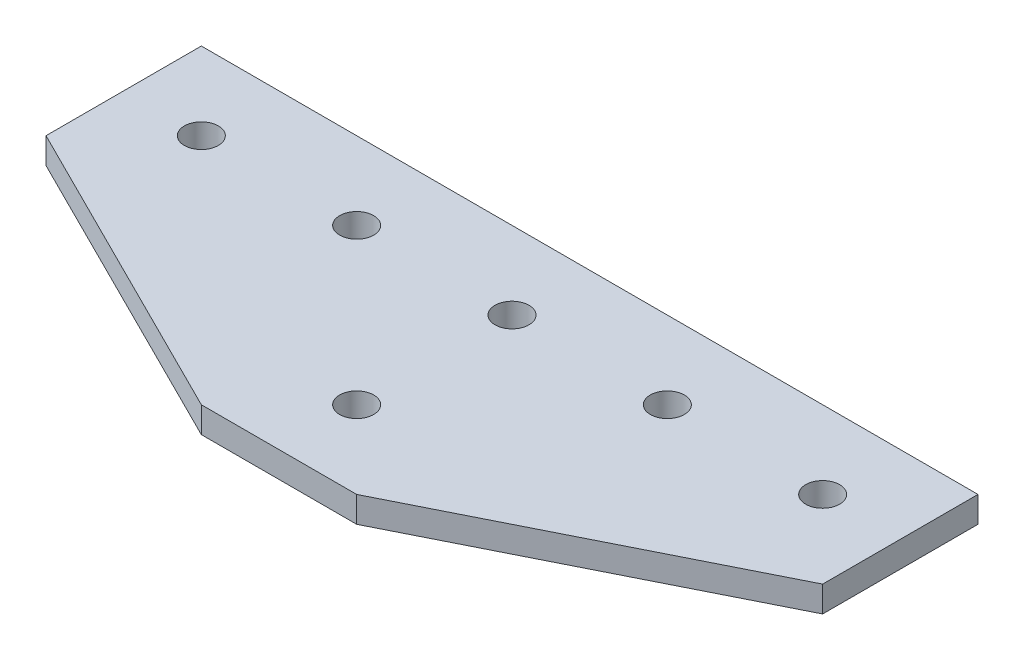
ISO-10303-21;
HEADER;
FILE_DESCRIPTION(('STEP AP214'),'2;1');
FILE_NAME('part.step','',(''),(''),'','','');
FILE_SCHEMA(('AUTOMOTIVE_DESIGN { 1 0 10303 214 1 1 1 1 }'));
ENDSEC;
DATA;
#1=APPLICATION_CONTEXT('core data for automotive mechanical design processes');
#2=APPLICATION_PROTOCOL_DEFINITION('international standard','automotive_design',2000,#1);
#3=PRODUCT_CONTEXT('',#1,'mechanical');
#4=PRODUCT('Part','Part','',(#3));
#5=PRODUCT_RELATED_PRODUCT_CATEGORY('part','',(#4));
#6=PRODUCT_DEFINITION_FORMATION('','',#4);
#7=PRODUCT_DEFINITION_CONTEXT('part definition',#1,'design');
#8=PRODUCT_DEFINITION('design','',#6,#7);
#9=PRODUCT_DEFINITION_SHAPE('','',#8);
#10=(LENGTH_UNIT() NAMED_UNIT(*) SI_UNIT(.MILLI.,.METRE.));
#11=(NAMED_UNIT(*) PLANE_ANGLE_UNIT() SI_UNIT($,.RADIAN.));
#12=(NAMED_UNIT(*) SI_UNIT($,.STERADIAN.) SOLID_ANGLE_UNIT());
#13=UNCERTAINTY_MEASURE_WITH_UNIT(LENGTH_MEASURE(1.E-05),#10,'distance_accuracy_value','');
#14=(GEOMETRIC_REPRESENTATION_CONTEXT(3) GLOBAL_UNCERTAINTY_ASSIGNED_CONTEXT((#13)) GLOBAL_UNIT_ASSIGNED_CONTEXT((#10,
#11,#12)) REPRESENTATION_CONTEXT('',''));
#15=CARTESIAN_POINT('',(0.,0.,0.));
#16=DIRECTION('',(0.,0.,1.));
#17=DIRECTION('',(1.,0.,0.));
#18=AXIS2_PLACEMENT_3D('',#15,#16,#17);
#19=CARTESIAN_POINT('',(-190.5,-6.35,38.1));
#20=DIRECTION('',(-1.,0.,0.));
#21=DIRECTION('',(0.,1.,0.));
#22=AXIS2_PLACEMENT_3D('',#19,#20,#21);
#23=PLANE('',#22);
#24=DIRECTION('',(0.,0.,-1.));
#25=VECTOR('',#24,1.);
#26=CARTESIAN_POINT('',(-190.5,-6.35,38.1));
#27=LINE('',#26,#25);
#28=CARTESIAN_POINT('',(-190.5,-6.35,38.1));
#29=VERTEX_POINT('',#28);
#30=CARTESIAN_POINT('',(-190.5,-6.35,0.));
#31=VERTEX_POINT('',#30);
#32=EDGE_CURVE('E95',#29,#31,#27,.T.);
#33=ORIENTED_EDGE('',*,*,#32,.F.);
#34=DIRECTION('',(0.,-1.,0.));
#35=VECTOR('',#34,1.);
#36=CARTESIAN_POINT('',(-190.5,-3.175,38.1));
#37=LINE('',#36,#35);
#38=CARTESIAN_POINT('',(-190.5,0.,38.1));
#39=VERTEX_POINT('',#38);
#40=EDGE_CURVE('E99',#39,#29,#37,.T.);
#41=ORIENTED_EDGE('',*,*,#40,.F.);
#42=DIRECTION('',(0.,0.,1.));
#43=VECTOR('',#42,1.);
#44=CARTESIAN_POINT('',(-190.5,0.,38.1));
#45=LINE('',#44,#43);
#46=CARTESIAN_POINT('',(-190.5,0.,0.));
#47=VERTEX_POINT('',#46);
#48=EDGE_CURVE('E108',#47,#39,#45,.T.);
#49=ORIENTED_EDGE('',*,*,#48,.F.);
#50=DIRECTION('',(0.,1.,0.));
#51=VECTOR('',#50,1.);
#52=CARTESIAN_POINT('',(-190.5,-3.175,0.));
#53=LINE('',#52,#51);
#54=EDGE_CURVE('E314',#31,#47,#53,.T.);
#55=ORIENTED_EDGE('',*,*,#54,.F.);
#56=EDGE_LOOP('',(#33,#41,#49,#55));
#57=FACE_BOUND('',#56,.T.);
#58=ADVANCED_FACE('F16',(#57),#23,.T.);
#59=CARTESIAN_POINT('',(-114.3,0.,76.2));
#60=DIRECTION('',(-0.447213595499958,0.,0.894427190999916));
#61=DIRECTION('',(-0.894427190999916,0.,-0.447213595499958));
#62=AXIS2_PLACEMENT_3D('',#59,#60,#61);
#63=PLANE('',#62);
#64=DIRECTION('',(-0.894427190999916,0.,-0.447213595499958));
#65=VECTOR('',#64,1.);
#66=CARTESIAN_POINT('',(-114.3,-6.35,76.2));
#67=LINE('',#66,#65);
#68=CARTESIAN_POINT('',(-114.3,-6.35,76.2));
#69=VERTEX_POINT('',#68);
#70=EDGE_CURVE('E93',#69,#29,#67,.T.);
#71=ORIENTED_EDGE('',*,*,#70,.F.);
#72=DIRECTION('',(0.,-1.,0.));
#73=VECTOR('',#72,1.);
#74=CARTESIAN_POINT('',(-114.3,-3.175,76.2));
#75=LINE('',#74,#73);
#76=CARTESIAN_POINT('',(-114.3,0.,76.2));
#77=VERTEX_POINT('',#76);
#78=EDGE_CURVE('E81',#77,#69,#75,.T.);
#79=ORIENTED_EDGE('',*,*,#78,.F.);
#80=DIRECTION('',(0.894427190999916,0.,0.447213595499958));
#81=VECTOR('',#80,1.);
#82=CARTESIAN_POINT('',(-190.5,0.,38.1));
#83=LINE('',#82,#81);
#84=EDGE_CURVE('E110',#39,#77,#83,.T.);
#85=ORIENTED_EDGE('',*,*,#84,.F.);
#86=ORIENTED_EDGE('',*,*,#40,.T.);
#87=EDGE_LOOP('',(#71,#79,#85,#86));
#88=FACE_BOUND('',#87,.T.);
#89=ADVANCED_FACE('F191',(#88),#63,.T.);
#90=CARTESIAN_POINT('',(-76.2,0.,76.2));
#91=DIRECTION('',(0.,0.,1.));
#92=DIRECTION('',(-1.,0.,0.));
#93=AXIS2_PLACEMENT_3D('',#90,#91,#92);
#94=PLANE('',#93);
#95=DIRECTION('',(-1.,0.,0.));
#96=VECTOR('',#95,1.);
#97=CARTESIAN_POINT('',(-95.25,-6.35,76.2));
#98=LINE('',#97,#96);
#99=CARTESIAN_POINT('',(-76.2,-6.35,76.2));
#100=VERTEX_POINT('',#99);
#101=EDGE_CURVE('E87',#100,#69,#98,.T.);
#102=ORIENTED_EDGE('',*,*,#101,.F.);
#103=DIRECTION('',(0.,-1.,0.));
#104=VECTOR('',#103,1.);
#105=CARTESIAN_POINT('',(-76.2,-3.175,76.2));
#106=LINE('',#105,#104);
#107=CARTESIAN_POINT('',(-76.2,0.,76.2));
#108=VERTEX_POINT('',#107);
#109=EDGE_CURVE('E74',#108,#100,#106,.T.);
#110=ORIENTED_EDGE('',*,*,#109,.F.);
#111=DIRECTION('',(1.,0.,0.));
#112=VECTOR('',#111,1.);
#113=CARTESIAN_POINT('',(-95.25,0.,76.2));
#114=LINE('',#113,#112);
#115=EDGE_CURVE('E112',#77,#108,#114,.T.);
#116=ORIENTED_EDGE('',*,*,#115,.F.);
#117=ORIENTED_EDGE('',*,*,#78,.T.);
#118=EDGE_LOOP('',(#102,#110,#116,#117));
#119=FACE_BOUND('',#118,.T.);
#120=ADVANCED_FACE('F91',(#119),#94,.T.);
#121=CARTESIAN_POINT('',(0.,0.,38.1));
#122=DIRECTION('',(0.447213595499958,0.,0.894427190999916));
#123=DIRECTION('',(-0.894427190999916,0.,0.447213595499958));
#124=AXIS2_PLACEMENT_3D('',#121,#122,#123);
#125=PLANE('',#124);
#126=DIRECTION('',(-0.894427190999916,0.,0.447213595499958));
#127=VECTOR('',#126,1.);
#128=CARTESIAN_POINT('',(0.,-6.35,38.1));
#129=LINE('',#128,#127);
#130=CARTESIAN_POINT('',(0.,-6.35,38.1));
#131=VERTEX_POINT('',#130);
#132=EDGE_CURVE('E20',#131,#100,#129,.T.);
#133=ORIENTED_EDGE('',*,*,#132,.F.);
#134=DIRECTION('',(0.,-1.,0.));
#135=VECTOR('',#134,1.);
#136=CARTESIAN_POINT('',(0.,-3.175,38.1));
#137=LINE('',#136,#135);
#138=CARTESIAN_POINT('',(0.,0.,38.1));
#139=VERTEX_POINT('',#138);
#140=EDGE_CURVE('E67',#139,#131,#137,.T.);
#141=ORIENTED_EDGE('',*,*,#140,.F.);
#142=DIRECTION('',(0.894427190999916,0.,-0.447213595499958));
#143=VECTOR('',#142,1.);
#144=CARTESIAN_POINT('',(-76.2,0.,76.2));
#145=LINE('',#144,#143);
#146=EDGE_CURVE('E77',#108,#139,#145,.T.);
#147=ORIENTED_EDGE('',*,*,#146,.F.);
#148=ORIENTED_EDGE('',*,*,#109,.T.);
#149=EDGE_LOOP('',(#133,#141,#147,#148));
#150=FACE_BOUND('',#149,.T.);
#151=ADVANCED_FACE('F76',(#150),#125,.T.);
#152=CARTESIAN_POINT('',(0.,0.,38.1));
#153=DIRECTION('',(1.,0.,0.));
#154=DIRECTION('',(0.,-1.,0.));
#155=AXIS2_PLACEMENT_3D('',#152,#153,#154);
#156=PLANE('',#155);
#157=DIRECTION('',(0.,0.,1.));
#158=VECTOR('',#157,1.);
#159=CARTESIAN_POINT('',(0.,-6.35,38.1));
#160=LINE('',#159,#158);
#161=CARTESIAN_POINT('',(0.,-6.35,0.));
#162=VERTEX_POINT('',#161);
#163=EDGE_CURVE('E90',#162,#131,#160,.T.);
#164=ORIENTED_EDGE('',*,*,#163,.F.);
#165=DIRECTION('',(0.,-1.,0.));
#166=VECTOR('',#165,1.);
#167=CARTESIAN_POINT('',(0.,-3.175,0.));
#168=LINE('',#167,#166);
#169=CARTESIAN_POINT('',(0.,0.,0.));
#170=VERTEX_POINT('',#169);
#171=EDGE_CURVE('E105',#170,#162,#168,.T.);
#172=ORIENTED_EDGE('',*,*,#171,.F.);
#173=DIRECTION('',(0.,0.,-1.));
#174=VECTOR('',#173,1.);
#175=CARTESIAN_POINT('',(0.,0.,38.1));
#176=LINE('',#175,#174);
#177=EDGE_CURVE('E35',#139,#170,#176,.T.);
#178=ORIENTED_EDGE('',*,*,#177,.F.);
#179=ORIENTED_EDGE('',*,*,#140,.T.);
#180=EDGE_LOOP('',(#164,#172,#178,#179));
#181=FACE_BOUND('',#180,.T.);
#182=ADVANCED_FACE('F183',(#181),#156,.T.);
#183=CARTESIAN_POINT('',(-190.5,0.,0.));
#184=DIRECTION('',(0.,0.,-1.));
#185=DIRECTION('',(1.,0.,0.));
#186=AXIS2_PLACEMENT_3D('',#183,#184,#185);
#187=PLANE('',#186);
#188=DIRECTION('',(1.,0.,0.));
#189=VECTOR('',#188,1.);
#190=CARTESIAN_POINT('',(-95.25,-6.35,0.));
#191=LINE('',#190,#189);
#192=EDGE_CURVE('E106',#31,#162,#191,.T.);
#193=ORIENTED_EDGE('',*,*,#192,.F.);
#194=ORIENTED_EDGE('',*,*,#54,.T.);
#195=DIRECTION('',(-1.,0.,0.));
#196=VECTOR('',#195,1.);
#197=CARTESIAN_POINT('',(-95.25,0.,0.));
#198=LINE('',#197,#196);
#199=EDGE_CURVE('E114',#170,#47,#198,.T.);
#200=ORIENTED_EDGE('',*,*,#199,.F.);
#201=ORIENTED_EDGE('',*,*,#171,.T.);
#202=EDGE_LOOP('',(#193,#194,#200,#201));
#203=FACE_BOUND('',#202,.T.);
#204=ADVANCED_FACE('F155',(#203),#187,.T.);
#205=CARTESIAN_POINT('',(-95.25,-6.35,19.05));
#206=DIRECTION('',(0.,1.,0.));
#207=DIRECTION('',(0.,0.,1.));
#208=AXIS2_PLACEMENT_3D('',#205,#206,#207);
#209=CYLINDRICAL_SURFACE('',#208,4.16559999999999);
#210=CARTESIAN_POINT('',(-95.25,-6.35,19.05));
#211=DIRECTION('',(0.,1.,0.));
#212=DIRECTION('',(0.,0.,1.));
#213=AXIS2_PLACEMENT_3D('',#210,#211,#212);
#214=CIRCLE('',#213,4.16559999999999);
#215=CARTESIAN_POINT('',(-95.25,-6.35,23.2156));
#216=VERTEX_POINT('',#215);
#217=EDGE_CURVE('E103',#216,#216,#214,.T.);
#218=ORIENTED_EDGE('',*,*,#217,.F.);
#219=EDGE_LOOP('',(#218));
#220=FACE_BOUND('',#219,.T.);
#221=CARTESIAN_POINT('',(-95.25,0.,19.05));
#222=DIRECTION('',(0.,1.,0.));
#223=DIRECTION('',(0.,0.,1.));
#224=AXIS2_PLACEMENT_3D('',#221,#222,#223);
#225=CIRCLE('',#224,4.16559999999999);
#226=CARTESIAN_POINT('',(-95.25,0.,23.2156));
#227=VERTEX_POINT('',#226);
#228=EDGE_CURVE('E130',#227,#227,#225,.F.);
#229=ORIENTED_EDGE('',*,*,#228,.F.);
#230=EDGE_LOOP('',(#229));
#231=FACE_BOUND('',#230,.T.);
#232=ADVANCED_FACE('F151',(#220,#231),#209,.F.);
#233=CARTESIAN_POINT('',(-171.45,-6.35,19.05));
#234=DIRECTION('',(0.,1.,0.));
#235=DIRECTION('',(0.,0.,1.));
#236=AXIS2_PLACEMENT_3D('',#233,#234,#235);
#237=CYLINDRICAL_SURFACE('',#236,4.1656);
#238=CARTESIAN_POINT('',(-171.45,-6.35,19.05));
#239=DIRECTION('',(0.,1.,0.));
#240=DIRECTION('',(0.,0.,1.));
#241=AXIS2_PLACEMENT_3D('',#238,#239,#240);
#242=CIRCLE('',#241,4.1656);
#243=CARTESIAN_POINT('',(-171.45,-6.35,23.2156));
#244=VERTEX_POINT('',#243);
#245=EDGE_CURVE('E143',#244,#244,#242,.T.);
#246=ORIENTED_EDGE('',*,*,#245,.F.);
#247=EDGE_LOOP('',(#246));
#248=FACE_BOUND('',#247,.T.);
#249=CARTESIAN_POINT('',(-171.45,0.,19.05));
#250=DIRECTION('',(0.,1.,0.));
#251=DIRECTION('',(0.,0.,1.));
#252=AXIS2_PLACEMENT_3D('',#249,#250,#251);
#253=CIRCLE('',#252,4.1656);
#254=CARTESIAN_POINT('',(-171.45,0.,23.2156));
#255=VERTEX_POINT('',#254);
#256=EDGE_CURVE('E127',#255,#255,#253,.F.);
#257=ORIENTED_EDGE('',*,*,#256,.F.);
#258=EDGE_LOOP('',(#257));
#259=FACE_BOUND('',#258,.T.);
#260=ADVANCED_FACE('F154',(#248,#259),#237,.F.);
#261=CARTESIAN_POINT('',(-133.35,-6.35,19.05));
#262=DIRECTION('',(0.,1.,0.));
#263=DIRECTION('',(0.,0.,1.));
#264=AXIS2_PLACEMENT_3D('',#261,#262,#263);
#265=CYLINDRICAL_SURFACE('',#264,4.16559999999999);
#266=CARTESIAN_POINT('',(-133.35,-6.35,19.05));
#267=DIRECTION('',(0.,1.,0.));
#268=DIRECTION('',(0.,0.,1.));
#269=AXIS2_PLACEMENT_3D('',#266,#267,#268);
#270=CIRCLE('',#269,4.16559999999999);
#271=CARTESIAN_POINT('',(-133.35,-6.35,23.2156));
#272=VERTEX_POINT('',#271);
#273=EDGE_CURVE('E140',#272,#272,#270,.T.);
#274=ORIENTED_EDGE('',*,*,#273,.F.);
#275=EDGE_LOOP('',(#274));
#276=FACE_BOUND('',#275,.T.);
#277=CARTESIAN_POINT('',(-133.35,0.,19.05));
#278=DIRECTION('',(0.,1.,0.));
#279=DIRECTION('',(0.,0.,1.));
#280=AXIS2_PLACEMENT_3D('',#277,#278,#279);
#281=CIRCLE('',#280,4.16559999999999);
#282=CARTESIAN_POINT('',(-133.35,0.,23.2156));
#283=VERTEX_POINT('',#282);
#284=EDGE_CURVE('E124',#283,#283,#281,.F.);
#285=ORIENTED_EDGE('',*,*,#284,.F.);
#286=EDGE_LOOP('',(#285));
#287=FACE_BOUND('',#286,.T.);
#288=ADVANCED_FACE('F200',(#276,#287),#265,.F.);
#289=CARTESIAN_POINT('',(-19.05,0.,19.05));
#290=DIRECTION('',(0.,-1.,0.));
#291=DIRECTION('',(0.,0.,-1.));
#292=AXIS2_PLACEMENT_3D('',#289,#290,#291);
#293=CYLINDRICAL_SURFACE('',#292,4.1656);
#294=CARTESIAN_POINT('',(-19.05,-6.35,19.05));
#295=DIRECTION('',(0.,-1.,0.));
#296=DIRECTION('',(0.,0.,-1.));
#297=AXIS2_PLACEMENT_3D('',#294,#295,#296);
#298=CIRCLE('',#297,4.1656);
#299=CARTESIAN_POINT('',(-19.05,-6.35,14.8844));
#300=VERTEX_POINT('',#299);
#301=EDGE_CURVE('E137',#300,#300,#298,.F.);
#302=ORIENTED_EDGE('',*,*,#301,.F.);
#303=EDGE_LOOP('',(#302));
#304=FACE_BOUND('',#303,.T.);
#305=CARTESIAN_POINT('',(-19.05,0.,19.05));
#306=DIRECTION('',(0.,-1.,0.));
#307=DIRECTION('',(0.,0.,-1.));
#308=AXIS2_PLACEMENT_3D('',#305,#306,#307);
#309=CIRCLE('',#308,4.1656);
#310=CARTESIAN_POINT('',(-19.05,0.,14.8844));
#311=VERTEX_POINT('',#310);
#312=EDGE_CURVE('E121',#311,#311,#309,.T.);
#313=ORIENTED_EDGE('',*,*,#312,.F.);
#314=EDGE_LOOP('',(#313));
#315=FACE_BOUND('',#314,.T.);
#316=ADVANCED_FACE('F176',(#304,#315),#293,.F.);
#317=CARTESIAN_POINT('',(-57.15,0.,19.05));
#318=DIRECTION('',(0.,-1.,0.));
#319=DIRECTION('',(0.,0.,-1.));
#320=AXIS2_PLACEMENT_3D('',#317,#318,#319);
#321=CYLINDRICAL_SURFACE('',#320,4.1656);
#322=CARTESIAN_POINT('',(-57.15,-6.35,19.05));
#323=DIRECTION('',(0.,-1.,0.));
#324=DIRECTION('',(0.,0.,-1.));
#325=AXIS2_PLACEMENT_3D('',#322,#323,#324);
#326=CIRCLE('',#325,4.1656);
#327=CARTESIAN_POINT('',(-57.15,-6.35,14.8844));
#328=VERTEX_POINT('',#327);
#329=EDGE_CURVE('E111',#328,#328,#326,.F.);
#330=ORIENTED_EDGE('',*,*,#329,.F.);
#331=EDGE_LOOP('',(#330));
#332=FACE_BOUND('',#331,.T.);
#333=CARTESIAN_POINT('',(-57.15,0.,19.05));
#334=DIRECTION('',(0.,-1.,0.));
#335=DIRECTION('',(0.,0.,-1.));
#336=AXIS2_PLACEMENT_3D('',#333,#334,#335);
#337=CIRCLE('',#336,4.1656);
#338=CARTESIAN_POINT('',(-57.15,0.,14.8844));
#339=VERTEX_POINT('',#338);
#340=EDGE_CURVE('E118',#339,#339,#337,.T.);
#341=ORIENTED_EDGE('',*,*,#340,.F.);
#342=EDGE_LOOP('',(#341));
#343=FACE_BOUND('',#342,.T.);
#344=ADVANCED_FACE('F170',(#332,#343),#321,.F.);
#345=CARTESIAN_POINT('',(0.,-6.35,76.2));
#346=DIRECTION('',(0.,-1.,0.));
#347=DIRECTION('',(-1.,0.,0.));
#348=AXIS2_PLACEMENT_3D('',#345,#346,#347);
#349=PLANE('',#348);
#350=ORIENTED_EDGE('',*,*,#329,.T.);
#351=EDGE_LOOP('',(#350));
#352=FACE_BOUND('',#351,.T.);
#353=ORIENTED_EDGE('',*,*,#301,.T.);
#354=EDGE_LOOP('',(#353));
#355=FACE_BOUND('',#354,.T.);
#356=ORIENTED_EDGE('',*,*,#273,.T.);
#357=EDGE_LOOP('',(#356));
#358=FACE_BOUND('',#357,.T.);
#359=ORIENTED_EDGE('',*,*,#245,.T.);
#360=EDGE_LOOP('',(#359));
#361=FACE_BOUND('',#360,.T.);
#362=ORIENTED_EDGE('',*,*,#217,.T.);
#363=EDGE_LOOP('',(#362));
#364=FACE_BOUND('',#363,.T.);
#365=CARTESIAN_POINT('',(-95.25,-6.35,57.15));
#366=DIRECTION('',(0.,1.,0.));
#367=DIRECTION('',(0.,0.,1.));
#368=AXIS2_PLACEMENT_3D('',#365,#366,#367);
#369=CIRCLE('',#368,4.16559999999999);
#370=CARTESIAN_POINT('',(-95.25,-6.35,61.3156));
#371=VERTEX_POINT('',#370);
#372=EDGE_CURVE('E26',#371,#371,#369,.F.);
#373=ORIENTED_EDGE('',*,*,#372,.F.);
#374=EDGE_LOOP('',(#373));
#375=FACE_BOUND('',#374,.T.);
#376=ORIENTED_EDGE('',*,*,#70,.T.);
#377=ORIENTED_EDGE('',*,*,#32,.T.);
#378=ORIENTED_EDGE('',*,*,#192,.T.);
#379=ORIENTED_EDGE('',*,*,#163,.T.);
#380=ORIENTED_EDGE('',*,*,#132,.T.);
#381=ORIENTED_EDGE('',*,*,#101,.T.);
#382=EDGE_LOOP('',(#376,#377,#378,#379,#380,#381));
#383=FACE_BOUND('',#382,.T.);
#384=ADVANCED_FACE('F86',(#352,#355,#358,#361,#364,#375,#383),#349,.T.);
#385=CARTESIAN_POINT('',(-190.5,0.,76.2));
#386=DIRECTION('',(0.,1.,0.));
#387=DIRECTION('',(1.,0.,0.));
#388=AXIS2_PLACEMENT_3D('',#385,#386,#387);
#389=PLANE('',#388);
#390=ORIENTED_EDGE('',*,*,#340,.T.);
#391=EDGE_LOOP('',(#390));
#392=FACE_BOUND('',#391,.T.);
#393=ORIENTED_EDGE('',*,*,#312,.T.);
#394=EDGE_LOOP('',(#393));
#395=FACE_BOUND('',#394,.T.);
#396=ORIENTED_EDGE('',*,*,#284,.T.);
#397=EDGE_LOOP('',(#396));
#398=FACE_BOUND('',#397,.T.);
#399=ORIENTED_EDGE('',*,*,#256,.T.);
#400=EDGE_LOOP('',(#399));
#401=FACE_BOUND('',#400,.T.);
#402=ORIENTED_EDGE('',*,*,#228,.T.);
#403=EDGE_LOOP('',(#402));
#404=FACE_BOUND('',#403,.T.);
#405=CARTESIAN_POINT('',(-95.25,0.,57.15));
#406=DIRECTION('',(0.,1.,0.));
#407=DIRECTION('',(0.,0.,1.));
#408=AXIS2_PLACEMENT_3D('',#405,#406,#407);
#409=CIRCLE('',#408,4.16559999999999);
#410=CARTESIAN_POINT('',(-95.25,0.,61.3156));
#411=VERTEX_POINT('',#410);
#412=EDGE_CURVE('E11',#411,#411,#409,.T.);
#413=ORIENTED_EDGE('',*,*,#412,.F.);
#414=EDGE_LOOP('',(#413));
#415=FACE_BOUND('',#414,.T.);
#416=ORIENTED_EDGE('',*,*,#177,.T.);
#417=ORIENTED_EDGE('',*,*,#199,.T.);
#418=ORIENTED_EDGE('',*,*,#48,.T.);
#419=ORIENTED_EDGE('',*,*,#84,.T.);
#420=ORIENTED_EDGE('',*,*,#115,.T.);
#421=ORIENTED_EDGE('',*,*,#146,.T.);
#422=EDGE_LOOP('',(#416,#417,#418,#419,#420,#421));
#423=FACE_BOUND('',#422,.T.);
#424=ADVANCED_FACE('F18',(#392,#395,#398,#401,#404,#415,#423),#389,.T.);
#425=CARTESIAN_POINT('',(-95.25,-6.35,57.15));
#426=DIRECTION('',(0.,1.,0.));
#427=DIRECTION('',(0.,0.,1.));
#428=AXIS2_PLACEMENT_3D('',#425,#426,#427);
#429=CYLINDRICAL_SURFACE('',#428,4.16559999999999);
#430=ORIENTED_EDGE('',*,*,#412,.T.);
#431=EDGE_LOOP('',(#430));
#432=FACE_BOUND('',#431,.T.);
#433=ORIENTED_EDGE('',*,*,#372,.T.);
#434=EDGE_LOOP('',(#433));
#435=FACE_BOUND('',#434,.T.);
#436=ADVANCED_FACE('F161',(#432,#435),#429,.F.);
#437=CLOSED_SHELL('',(#58,#89,#120,#151,#182,#204,#232,#260,#288,#316,#344,#384,#424,#436));
#438=MANIFOLD_SOLID_BREP('B1',#437);
#439=ADVANCED_BREP_SHAPE_REPRESENTATION('',(#18,#438),#14);
#440=SHAPE_DEFINITION_REPRESENTATION(#9,#439);
ENDSEC;
END-ISO-10303-21;
